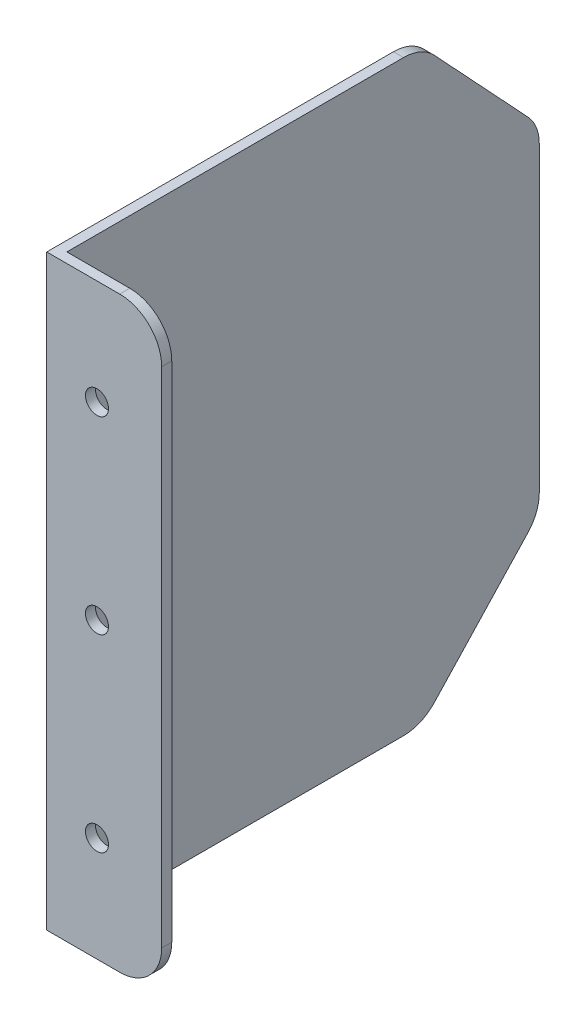
ISO-10303-21;
HEADER;
FILE_DESCRIPTION(('STEP AP214'),'2;1');
FILE_NAME('part.step','',(''),(''),'','','');
FILE_SCHEMA(('AUTOMOTIVE_DESIGN { 1 0 10303 214 1 1 1 1 }'));
ENDSEC;
DATA;
#1=APPLICATION_CONTEXT('core data for automotive mechanical design processes');
#2=APPLICATION_PROTOCOL_DEFINITION('international standard','automotive_design',2000,#1);
#3=PRODUCT_CONTEXT('',#1,'mechanical');
#4=PRODUCT('Part','Part','',(#3));
#5=PRODUCT_RELATED_PRODUCT_CATEGORY('part','',(#4));
#6=PRODUCT_DEFINITION_FORMATION('','',#4);
#7=PRODUCT_DEFINITION_CONTEXT('part definition',#1,'design');
#8=PRODUCT_DEFINITION('design','',#6,#7);
#9=PRODUCT_DEFINITION_SHAPE('','',#8);
#10=(LENGTH_UNIT() NAMED_UNIT(*) SI_UNIT(.MILLI.,.METRE.));
#11=(NAMED_UNIT(*) PLANE_ANGLE_UNIT() SI_UNIT($,.RADIAN.));
#12=(NAMED_UNIT(*) SI_UNIT($,.STERADIAN.) SOLID_ANGLE_UNIT());
#13=UNCERTAINTY_MEASURE_WITH_UNIT(LENGTH_MEASURE(1.E-05),#10,'distance_accuracy_value','');
#14=(GEOMETRIC_REPRESENTATION_CONTEXT(3) GLOBAL_UNCERTAINTY_ASSIGNED_CONTEXT((#13)) GLOBAL_UNIT_ASSIGNED_CONTEXT((#10,
#11,#12)) REPRESENTATION_CONTEXT('',''));
#15=CARTESIAN_POINT('',(0.,0.,0.));
#16=DIRECTION('',(0.,0.,1.));
#17=DIRECTION('',(1.,0.,0.));
#18=AXIS2_PLACEMENT_3D('',#15,#16,#17);
#19=CARTESIAN_POINT('',(2.4,0.,0.));
#20=DIRECTION('',(0.,0.,-1.));
#21=DIRECTION('',(0.,1.,0.));
#22=AXIS2_PLACEMENT_3D('',#19,#20,#21);
#23=PLANE('',#22);
#24=CARTESIAN_POINT('',(11.9749835807568,-115.,0.));
#25=DIRECTION('',(0.,0.,1.));
#26=DIRECTION('',(1.,0.,0.));
#27=AXIS2_PLACEMENT_3D('',#24,#25,#26);
#28=CIRCLE('',#27,2.75);
#29=CARTESIAN_POINT('',(14.7249835807568,-115.,0.));
#30=VERTEX_POINT('',#29);
#31=EDGE_CURVE('E481',#30,#30,#28,.T.);
#32=ORIENTED_EDGE('',*,*,#31,.F.);
#33=EDGE_LOOP('',(#32));
#34=FACE_BOUND('',#33,.T.);
#35=CARTESIAN_POINT('',(11.9749835807568,-25.,0.));
#36=DIRECTION('',(0.,0.,1.));
#37=DIRECTION('',(1.,0.,0.));
#38=AXIS2_PLACEMENT_3D('',#35,#36,#37);
#39=CIRCLE('',#38,2.75);
#40=CARTESIAN_POINT('',(14.7249835807568,-25.,0.));
#41=VERTEX_POINT('',#40);
#42=EDGE_CURVE('E482',#41,#41,#39,.T.);
#43=ORIENTED_EDGE('',*,*,#42,.F.);
#44=EDGE_LOOP('',(#43));
#45=FACE_BOUND('',#44,.T.);
#46=CARTESIAN_POINT('',(11.9749835807568,-70.,0.));
#47=DIRECTION('',(0.,0.,1.));
#48=DIRECTION('',(1.,0.,0.));
#49=AXIS2_PLACEMENT_3D('',#46,#47,#48);
#50=CIRCLE('',#49,2.75);
#51=CARTESIAN_POINT('',(14.7249835807568,-70.,0.));
#52=VERTEX_POINT('',#51);
#53=EDGE_CURVE('E258',#52,#52,#50,.T.);
#54=ORIENTED_EDGE('',*,*,#53,.F.);
#55=EDGE_LOOP('',(#54));
#56=FACE_BOUND('',#55,.T.);
#57=DIRECTION('',(-1.,0.,0.));
#58=VECTOR('',#57,1.);
#59=CARTESIAN_POINT('',(2.4,-140.,0.));
#60=LINE('',#59,#58);
#61=CARTESIAN_POINT('',(17.4,-140.,0.));
#62=VERTEX_POINT('',#61);
#63=CARTESIAN_POINT('',(0.,-140.,0.));
#64=VERTEX_POINT('',#63);
#65=EDGE_CURVE('E204',#62,#64,#60,.T.);
#66=ORIENTED_EDGE('',*,*,#65,.F.);
#67=CARTESIAN_POINT('',(17.4,-130.,0.));
#68=DIRECTION('',(0.,0.,-1.));
#69=DIRECTION('',(0.,1.,0.));
#70=AXIS2_PLACEMENT_3D('',#67,#68,#69);
#71=CIRCLE('',#70,10.);
#72=CARTESIAN_POINT('',(27.4,-130.,0.));
#73=VERTEX_POINT('',#72);
#74=EDGE_CURVE('E48',#62,#73,#71,.F.);
#75=ORIENTED_EDGE('',*,*,#74,.T.);
#76=DIRECTION('',(0.,-1.,0.));
#77=VECTOR('',#76,1.);
#78=CARTESIAN_POINT('',(27.4,-140.,0.));
#79=LINE('',#78,#77);
#80=CARTESIAN_POINT('',(27.4,-10.,0.));
#81=VERTEX_POINT('',#80);
#82=EDGE_CURVE('E167',#81,#73,#79,.T.);
#83=ORIENTED_EDGE('',*,*,#82,.F.);
#84=CARTESIAN_POINT('',(17.4,-10.,0.));
#85=DIRECTION('',(0.,0.,-1.));
#86=DIRECTION('',(0.,1.,0.));
#87=AXIS2_PLACEMENT_3D('',#84,#85,#86);
#88=CIRCLE('',#87,10.);
#89=CARTESIAN_POINT('',(17.4,0.,0.));
#90=VERTEX_POINT('',#89);
#91=EDGE_CURVE('E57',#81,#90,#88,.F.);
#92=ORIENTED_EDGE('',*,*,#91,.T.);
#93=DIRECTION('',(-1.,0.,0.));
#94=VECTOR('',#93,1.);
#95=CARTESIAN_POINT('',(2.4,0.,0.));
#96=LINE('',#95,#94);
#97=CARTESIAN_POINT('',(0.,0.,0.));
#98=VERTEX_POINT('',#97);
#99=EDGE_CURVE('E161',#90,#98,#96,.T.);
#100=ORIENTED_EDGE('',*,*,#99,.T.);
#101=DIRECTION('',(0.,-1.,0.));
#102=VECTOR('',#101,1.);
#103=CARTESIAN_POINT('',(0.,0.,0.));
#104=LINE('',#103,#102);
#105=EDGE_CURVE('E179',#98,#64,#104,.T.);
#106=ORIENTED_EDGE('',*,*,#105,.T.);
#107=EDGE_LOOP('',(#66,#75,#83,#92,#100,#106));
#108=FACE_BOUND('',#107,.T.);
#109=ADVANCED_FACE('F39',(#34,#45,#56,#108),#23,.F.);
#110=CARTESIAN_POINT('',(2.4,-140.,0.));
#111=DIRECTION('',(0.,1.,0.));
#112=DIRECTION('',(0.,0.,1.));
#113=AXIS2_PLACEMENT_3D('',#110,#111,#112);
#114=PLANE('',#113);
#115=DIRECTION('',(-1.,0.,0.));
#116=VECTOR('',#115,1.);
#117=CARTESIAN_POINT('',(27.4,-140.,-2.4));
#118=LINE('',#117,#116);
#119=CARTESIAN_POINT('',(17.4,-140.,-2.4));
#120=VERTEX_POINT('',#119);
#121=CARTESIAN_POINT('',(2.4,-140.,-2.4));
#122=VERTEX_POINT('',#121);
#123=EDGE_CURVE('E151',#120,#122,#118,.T.);
#124=ORIENTED_EDGE('',*,*,#123,.F.);
#125=DIRECTION('',(0.,0.,-1.));
#126=VECTOR('',#125,1.);
#127=CARTESIAN_POINT('',(17.4,-140.,0.));
#128=LINE('',#127,#126);
#129=EDGE_CURVE('E63',#120,#62,#128,.F.);
#130=ORIENTED_EDGE('',*,*,#129,.T.);
#131=ORIENTED_EDGE('',*,*,#65,.T.);
#132=DIRECTION('',(0.,0.,-1.));
#133=VECTOR('',#132,1.);
#134=CARTESIAN_POINT('',(0.,-140.,0.));
#135=LINE('',#134,#133);
#136=CARTESIAN_POINT('',(0.,-140.,-82.6544769808779));
#137=VERTEX_POINT('',#136);
#138=EDGE_CURVE('E192',#64,#137,#135,.T.);
#139=ORIENTED_EDGE('',*,*,#138,.T.);
#140=DIRECTION('',(1.,0.,0.));
#141=VECTOR('',#140,1.);
#142=CARTESIAN_POINT('',(2.4,-140.,-82.6544769808779));
#143=LINE('',#142,#141);
#144=CARTESIAN_POINT('',(2.4,-140.,-82.6544769808779));
#145=VERTEX_POINT('',#144);
#146=EDGE_CURVE('E206',#137,#145,#143,.T.);
#147=ORIENTED_EDGE('',*,*,#146,.T.);
#148=DIRECTION('',(0.,0.,-1.));
#149=VECTOR('',#148,1.);
#150=CARTESIAN_POINT('',(2.4,-140.,0.));
#151=LINE('',#150,#149);
#152=EDGE_CURVE('E187',#122,#145,#151,.T.);
#153=ORIENTED_EDGE('',*,*,#152,.F.);
#154=EDGE_LOOP('',(#124,#130,#131,#139,#147,#153));
#155=FACE_BOUND('',#154,.T.);
#156=ADVANCED_FACE('F279',(#155),#114,.F.);
#157=CARTESIAN_POINT('',(2.4,0.,-115.));
#158=DIRECTION('',(0.,0.,1.));
#159=DIRECTION('',(0.,-1.,0.));
#160=AXIS2_PLACEMENT_3D('',#157,#158,#159);
#161=PLANE('',#160);
#162=DIRECTION('',(0.,1.,0.));
#163=VECTOR('',#162,1.);
#164=CARTESIAN_POINT('',(2.4,0.,-115.));
#165=LINE('',#164,#163);
#166=CARTESIAN_POINT('',(2.4,-106.058368193798,-115.));
#167=VERTEX_POINT('',#166);
#168=CARTESIAN_POINT('',(2.4,-33.9416318062023,-115.));
#169=VERTEX_POINT('',#168);
#170=EDGE_CURVE('E165',#167,#169,#165,.T.);
#171=ORIENTED_EDGE('',*,*,#170,.F.);
#172=DIRECTION('',(1.,0.,0.));
#173=VECTOR('',#172,1.);
#174=CARTESIAN_POINT('',(2.4,-106.058368193798,-115.));
#175=LINE('',#174,#173);
#176=CARTESIAN_POINT('',(0.,-106.058368193798,-115.));
#177=VERTEX_POINT('',#176);
#178=EDGE_CURVE('E235',#167,#177,#175,.F.);
#179=ORIENTED_EDGE('',*,*,#178,.T.);
#180=DIRECTION('',(0.,1.,0.));
#181=VECTOR('',#180,1.);
#182=CARTESIAN_POINT('',(0.,0.,-115.));
#183=LINE('',#182,#181);
#184=CARTESIAN_POINT('',(0.,-33.9416318062023,-115.));
#185=VERTEX_POINT('',#184);
#186=EDGE_CURVE('E196',#177,#185,#183,.T.);
#187=ORIENTED_EDGE('',*,*,#186,.T.);
#188=DIRECTION('',(1.,0.,0.));
#189=VECTOR('',#188,1.);
#190=CARTESIAN_POINT('',(2.4,-33.9416318062023,-115.));
#191=LINE('',#190,#189);
#192=EDGE_CURVE('E228',#185,#169,#191,.T.);
#193=ORIENTED_EDGE('',*,*,#192,.T.);
#194=EDGE_LOOP('',(#171,#179,#187,#193));
#195=FACE_BOUND('',#194,.T.);
#196=ADVANCED_FACE('F288',(#195),#161,.F.);
#197=CARTESIAN_POINT('',(2.4,0.,0.));
#198=DIRECTION('',(0.,-1.,0.));
#199=DIRECTION('',(0.,0.,-1.));
#200=AXIS2_PLACEMENT_3D('',#197,#198,#199);
#201=PLANE('',#200);
#202=ORIENTED_EDGE('',*,*,#99,.F.);
#203=DIRECTION('',(0.,0.,1.));
#204=VECTOR('',#203,1.);
#205=CARTESIAN_POINT('',(17.4,0.,0.));
#206=LINE('',#205,#204);
#207=CARTESIAN_POINT('',(17.4,0.,-2.4));
#208=VERTEX_POINT('',#207);
#209=EDGE_CURVE('E11',#90,#208,#206,.F.);
#210=ORIENTED_EDGE('',*,*,#209,.T.);
#211=DIRECTION('',(-1.,0.,0.));
#212=VECTOR('',#211,1.);
#213=CARTESIAN_POINT('',(27.4,0.,-2.4));
#214=LINE('',#213,#212);
#215=CARTESIAN_POINT('',(2.4,0.,-2.4));
#216=VERTEX_POINT('',#215);
#217=EDGE_CURVE('E142',#208,#216,#214,.T.);
#218=ORIENTED_EDGE('',*,*,#217,.T.);
#219=DIRECTION('',(0.,0.,1.));
#220=VECTOR('',#219,1.);
#221=CARTESIAN_POINT('',(2.4,0.,0.));
#222=LINE('',#221,#220);
#223=CARTESIAN_POINT('',(2.4,0.,-82.6544769808779));
#224=VERTEX_POINT('',#223);
#225=EDGE_CURVE('E144',#224,#216,#222,.T.);
#226=ORIENTED_EDGE('',*,*,#225,.F.);
#227=DIRECTION('',(1.,0.,0.));
#228=VECTOR('',#227,1.);
#229=CARTESIAN_POINT('',(2.4,0.,-82.6544769808779));
#230=LINE('',#229,#228);
#231=CARTESIAN_POINT('',(0.,0.,-82.6544769808779));
#232=VERTEX_POINT('',#231);
#233=EDGE_CURVE('E239',#224,#232,#230,.F.);
#234=ORIENTED_EDGE('',*,*,#233,.T.);
#235=DIRECTION('',(0.,0.,1.));
#236=VECTOR('',#235,1.);
#237=CARTESIAN_POINT('',(0.,0.,0.));
#238=LINE('',#237,#236);
#239=EDGE_CURVE('E189',#232,#98,#238,.T.);
#240=ORIENTED_EDGE('',*,*,#239,.T.);
#241=EDGE_LOOP('',(#202,#210,#218,#226,#234,#240));
#242=FACE_BOUND('',#241,.T.);
#243=ADVANCED_FACE('F145',(#242),#201,.F.);
#244=CARTESIAN_POINT('',(2.4,0.,0.));
#245=DIRECTION('',(1.,0.,0.));
#246=DIRECTION('',(0.,0.,-1.));
#247=AXIS2_PLACEMENT_3D('',#244,#245,#246);
#248=PLANE('',#247);
#249=DIRECTION('',(0.,1.,0.));
#250=VECTOR('',#249,1.);
#251=CARTESIAN_POINT('',(2.4,-140.,-2.4));
#252=LINE('',#251,#250);
#253=EDGE_CURVE('E160',#122,#216,#252,.T.);
#254=ORIENTED_EDGE('',*,*,#253,.F.);
#255=ORIENTED_EDGE('',*,*,#152,.T.);
#256=CARTESIAN_POINT('',(2.4,-130.,-82.6544769808779));
#257=DIRECTION('',(1.,0.,0.));
#258=DIRECTION('',(0.,0.,-1.));
#259=AXIS2_PLACEMENT_3D('',#256,#257,#258);
#260=CIRCLE('',#259,10.);
#261=CARTESIAN_POINT('',(2.4,-136.8231825036,-89.9650296633066));
#262=VERTEX_POINT('',#261);
#263=EDGE_CURVE('E212',#145,#262,#260,.T.);
#264=ORIENTED_EDGE('',*,*,#263,.T.);
#265=DIRECTION('',(0.,-0.731055268242869,0.682318250360011));
#266=VECTOR('',#265,1.);
#267=CARTESIAN_POINT('',(2.4,-110.,-115.));
#268=LINE('',#267,#266);
#269=CARTESIAN_POINT('',(2.4,-112.881550697398,-112.310552682429));
#270=VERTEX_POINT('',#269);
#271=EDGE_CURVE('E181',#270,#262,#268,.T.);
#272=ORIENTED_EDGE('',*,*,#271,.F.);
#273=CARTESIAN_POINT('',(2.4,-106.058368193798,-105.));
#274=DIRECTION('',(1.,0.,0.));
#275=DIRECTION('',(0.,0.,-1.));
#276=AXIS2_PLACEMENT_3D('',#273,#274,#275);
#277=CIRCLE('',#276,10.);
#278=EDGE_CURVE('E215',#270,#167,#277,.T.);
#279=ORIENTED_EDGE('',*,*,#278,.T.);
#280=ORIENTED_EDGE('',*,*,#170,.T.);
#281=CARTESIAN_POINT('',(2.4,-33.9416318062023,-105.));
#282=DIRECTION('',(1.,0.,0.));
#283=DIRECTION('',(0.,0.,-1.));
#284=AXIS2_PLACEMENT_3D('',#281,#282,#283);
#285=CIRCLE('',#284,10.);
#286=CARTESIAN_POINT('',(2.4,-27.1184493026022,-112.310552682429));
#287=VERTEX_POINT('',#286);
#288=EDGE_CURVE('E209',#169,#287,#285,.T.);
#289=ORIENTED_EDGE('',*,*,#288,.T.);
#290=DIRECTION('',(0.,-0.731055268242869,-0.682318250360012));
#291=VECTOR('',#290,1.);
#292=CARTESIAN_POINT('',(2.4,0.,-87.));
#293=LINE('',#292,#291);
#294=CARTESIAN_POINT('',(2.4,-3.17681749639988,-89.9650296633066));
#295=VERTEX_POINT('',#294);
#296=EDGE_CURVE('E177',#295,#287,#293,.T.);
#297=ORIENTED_EDGE('',*,*,#296,.F.);
#298=CARTESIAN_POINT('',(2.4,-10.,-82.6544769808779));
#299=DIRECTION('',(1.,0.,0.));
#300=DIRECTION('',(0.,0.,-1.));
#301=AXIS2_PLACEMENT_3D('',#298,#299,#300);
#302=CIRCLE('',#301,10.);
#303=EDGE_CURVE('E159',#295,#224,#302,.T.);
#304=ORIENTED_EDGE('',*,*,#303,.T.);
#305=ORIENTED_EDGE('',*,*,#225,.T.);
#306=EDGE_LOOP('',(#254,#255,#264,#272,#279,#280,#289,#297,#304,#305));
#307=FACE_BOUND('',#306,.T.);
#308=ADVANCED_FACE('F156',(#307),#248,.T.);
#309=CARTESIAN_POINT('',(0.,0.,0.));
#310=DIRECTION('',(1.,0.,0.));
#311=DIRECTION('',(0.,0.,-1.));
#312=AXIS2_PLACEMENT_3D('',#309,#310,#311);
#313=PLANE('',#312);
#314=DIRECTION('',(0.,-0.731055268242869,0.682318250360011));
#315=VECTOR('',#314,1.);
#316=CARTESIAN_POINT('',(0.,-110.,-115.));
#317=LINE('',#316,#315);
#318=CARTESIAN_POINT('',(0.,-112.881550697398,-112.310552682429));
#319=VERTEX_POINT('',#318);
#320=CARTESIAN_POINT('',(0.,-136.8231825036,-89.9650296633066));
#321=VERTEX_POINT('',#320);
#322=EDGE_CURVE('E174',#319,#321,#317,.T.);
#323=ORIENTED_EDGE('',*,*,#322,.T.);
#324=CARTESIAN_POINT('',(0.,-130.,-82.6544769808779));
#325=DIRECTION('',(1.,0.,0.));
#326=DIRECTION('',(0.,0.,-1.));
#327=AXIS2_PLACEMENT_3D('',#324,#325,#326);
#328=CIRCLE('',#327,10.);
#329=EDGE_CURVE('E230',#321,#137,#328,.F.);
#330=ORIENTED_EDGE('',*,*,#329,.T.);
#331=ORIENTED_EDGE('',*,*,#138,.F.);
#332=ORIENTED_EDGE('',*,*,#105,.F.);
#333=ORIENTED_EDGE('',*,*,#239,.F.);
#334=CARTESIAN_POINT('',(0.,-10.,-82.6544769808779));
#335=DIRECTION('',(1.,0.,0.));
#336=DIRECTION('',(0.,0.,-1.));
#337=AXIS2_PLACEMENT_3D('',#334,#335,#336);
#338=CIRCLE('',#337,10.);
#339=CARTESIAN_POINT('',(0.,-3.17681749639988,-89.9650296633066));
#340=VERTEX_POINT('',#339);
#341=EDGE_CURVE('E222',#232,#340,#338,.F.);
#342=ORIENTED_EDGE('',*,*,#341,.T.);
#343=DIRECTION('',(0.,-0.731055268242869,-0.682318250360012));
#344=VECTOR('',#343,1.);
#345=CARTESIAN_POINT('',(0.,0.,-87.));
#346=LINE('',#345,#344);
#347=CARTESIAN_POINT('',(0.,-27.1184493026022,-112.310552682429));
#348=VERTEX_POINT('',#347);
#349=EDGE_CURVE('E178',#340,#348,#346,.T.);
#350=ORIENTED_EDGE('',*,*,#349,.T.);
#351=CARTESIAN_POINT('',(0.,-33.9416318062023,-105.));
#352=DIRECTION('',(1.,0.,0.));
#353=DIRECTION('',(0.,0.,-1.));
#354=AXIS2_PLACEMENT_3D('',#351,#352,#353);
#355=CIRCLE('',#354,10.);
#356=EDGE_CURVE('E224',#348,#185,#355,.F.);
#357=ORIENTED_EDGE('',*,*,#356,.T.);
#358=ORIENTED_EDGE('',*,*,#186,.F.);
#359=CARTESIAN_POINT('',(0.,-106.058368193798,-105.));
#360=DIRECTION('',(1.,0.,0.));
#361=DIRECTION('',(0.,0.,-1.));
#362=AXIS2_PLACEMENT_3D('',#359,#360,#361);
#363=CIRCLE('',#362,10.);
#364=EDGE_CURVE('E223',#177,#319,#363,.F.);
#365=ORIENTED_EDGE('',*,*,#364,.T.);
#366=EDGE_LOOP('',(#323,#330,#331,#332,#333,#342,#350,#357,#358,#365));
#367=FACE_BOUND('',#366,.T.);
#368=ADVANCED_FACE('F332',(#367),#313,.F.);
#369=CARTESIAN_POINT('',(0.,0.,-87.));
#370=DIRECTION('',(0.,-0.682318250360011,0.731055268242869));
#371=DIRECTION('',(0.,-0.731055268242869,-0.682318250360012));
#372=AXIS2_PLACEMENT_3D('',#369,#370,#371);
#373=PLANE('',#372);
#374=ORIENTED_EDGE('',*,*,#296,.T.);
#375=DIRECTION('',(1.,0.,0.));
#376=VECTOR('',#375,1.);
#377=CARTESIAN_POINT('',(0.,-27.1184493026021,-112.310552682429));
#378=LINE('',#377,#376);
#379=EDGE_CURVE('E240',#287,#348,#378,.F.);
#380=ORIENTED_EDGE('',*,*,#379,.T.);
#381=ORIENTED_EDGE('',*,*,#349,.F.);
#382=DIRECTION('',(1.,0.,0.));
#383=VECTOR('',#382,1.);
#384=CARTESIAN_POINT('',(0.,-3.17681749639988,-89.9650296633066));
#385=LINE('',#384,#383);
#386=EDGE_CURVE('E234',#340,#295,#385,.T.);
#387=ORIENTED_EDGE('',*,*,#386,.T.);
#388=EDGE_LOOP('',(#374,#380,#381,#387));
#389=FACE_BOUND('',#388,.T.);
#390=ADVANCED_FACE('F345',(#389),#373,.F.);
#391=CARTESIAN_POINT('',(0.,-110.,-115.));
#392=DIRECTION('',(0.,0.682318250360011,0.731055268242869));
#393=DIRECTION('',(0.,-0.731055268242869,0.682318250360011));
#394=AXIS2_PLACEMENT_3D('',#391,#392,#393);
#395=PLANE('',#394);
#396=ORIENTED_EDGE('',*,*,#271,.T.);
#397=DIRECTION('',(1.,0.,0.));
#398=VECTOR('',#397,1.);
#399=CARTESIAN_POINT('',(0.,-136.8231825036,-89.9650296633066));
#400=LINE('',#399,#398);
#401=EDGE_CURVE('E218',#262,#321,#400,.F.);
#402=ORIENTED_EDGE('',*,*,#401,.T.);
#403=ORIENTED_EDGE('',*,*,#322,.F.);
#404=DIRECTION('',(1.,0.,0.));
#405=VECTOR('',#404,1.);
#406=CARTESIAN_POINT('',(0.,-112.881550697398,-112.310552682429));
#407=LINE('',#406,#405);
#408=EDGE_CURVE('E216',#319,#270,#407,.T.);
#409=ORIENTED_EDGE('',*,*,#408,.T.);
#410=EDGE_LOOP('',(#396,#402,#403,#409));
#411=FACE_BOUND('',#410,.T.);
#412=ADVANCED_FACE('F296',(#411),#395,.F.);
#413=CARTESIAN_POINT('',(2.4,-130.,-82.6544769808779));
#414=DIRECTION('',(1.,0.,0.));
#415=DIRECTION('',(0.,0.,-1.));
#416=AXIS2_PLACEMENT_3D('',#413,#414,#415);
#417=CYLINDRICAL_SURFACE('',#416,10.);
#418=ORIENTED_EDGE('',*,*,#329,.F.);
#419=ORIENTED_EDGE('',*,*,#401,.F.);
#420=ORIENTED_EDGE('',*,*,#263,.F.);
#421=ORIENTED_EDGE('',*,*,#146,.F.);
#422=EDGE_LOOP('',(#418,#419,#420,#421));
#423=FACE_BOUND('',#422,.T.);
#424=ADVANCED_FACE('F295',(#423),#417,.T.);
#425=CARTESIAN_POINT('',(0.,-106.058368193798,-105.));
#426=DIRECTION('',(1.,0.,0.));
#427=DIRECTION('',(0.,0.,-1.));
#428=AXIS2_PLACEMENT_3D('',#425,#426,#427);
#429=CYLINDRICAL_SURFACE('',#428,10.);
#430=ORIENTED_EDGE('',*,*,#364,.F.);
#431=ORIENTED_EDGE('',*,*,#178,.F.);
#432=ORIENTED_EDGE('',*,*,#278,.F.);
#433=ORIENTED_EDGE('',*,*,#408,.F.);
#434=EDGE_LOOP('',(#430,#431,#432,#433));
#435=FACE_BOUND('',#434,.T.);
#436=ADVANCED_FACE('F293',(#435),#429,.T.);
#437=CARTESIAN_POINT('',(2.4,-33.9416318062023,-105.));
#438=DIRECTION('',(1.,0.,0.));
#439=DIRECTION('',(0.,0.,-1.));
#440=AXIS2_PLACEMENT_3D('',#437,#438,#439);
#441=CYLINDRICAL_SURFACE('',#440,10.);
#442=ORIENTED_EDGE('',*,*,#356,.F.);
#443=ORIENTED_EDGE('',*,*,#379,.F.);
#444=ORIENTED_EDGE('',*,*,#288,.F.);
#445=ORIENTED_EDGE('',*,*,#192,.F.);
#446=EDGE_LOOP('',(#442,#443,#444,#445));
#447=FACE_BOUND('',#446,.T.);
#448=ADVANCED_FACE('F299',(#447),#441,.T.);
#449=CARTESIAN_POINT('',(0.,-10.,-82.6544769808779));
#450=DIRECTION('',(1.,0.,0.));
#451=DIRECTION('',(0.,0.,-1.));
#452=AXIS2_PLACEMENT_3D('',#449,#450,#451);
#453=CYLINDRICAL_SURFACE('',#452,10.);
#454=ORIENTED_EDGE('',*,*,#341,.F.);
#455=ORIENTED_EDGE('',*,*,#233,.F.);
#456=ORIENTED_EDGE('',*,*,#303,.F.);
#457=ORIENTED_EDGE('',*,*,#386,.F.);
#458=EDGE_LOOP('',(#454,#455,#456,#457));
#459=FACE_BOUND('',#458,.T.);
#460=ADVANCED_FACE('F304',(#459),#453,.T.);
#461=CARTESIAN_POINT('',(27.4,-140.,-2.4));
#462=DIRECTION('',(0.,0.,1.));
#463=DIRECTION('',(1.,0.,0.));
#464=AXIS2_PLACEMENT_3D('',#461,#462,#463);
#465=PLANE('',#464);
#466=CARTESIAN_POINT('',(11.9749835807568,-115.,-2.4));
#467=DIRECTION('',(0.,0.,1.));
#468=DIRECTION('',(1.,0.,0.));
#469=AXIS2_PLACEMENT_3D('',#466,#467,#468);
#470=CIRCLE('',#469,2.75);
#471=CARTESIAN_POINT('',(14.7249835807568,-115.,-2.4));
#472=VERTEX_POINT('',#471);
#473=EDGE_CURVE('E43',#472,#472,#470,.T.);
#474=ORIENTED_EDGE('',*,*,#473,.T.);
#475=EDGE_LOOP('',(#474));
#476=FACE_BOUND('',#475,.T.);
#477=CARTESIAN_POINT('',(11.9749835807568,-25.,-2.4));
#478=DIRECTION('',(0.,0.,1.));
#479=DIRECTION('',(1.,0.,0.));
#480=AXIS2_PLACEMENT_3D('',#477,#478,#479);
#481=CIRCLE('',#480,2.75);
#482=CARTESIAN_POINT('',(14.7249835807568,-25.,-2.4));
#483=VERTEX_POINT('',#482);
#484=EDGE_CURVE('E171',#483,#483,#481,.T.);
#485=ORIENTED_EDGE('',*,*,#484,.T.);
#486=EDGE_LOOP('',(#485));
#487=FACE_BOUND('',#486,.T.);
#488=CARTESIAN_POINT('',(11.9749835807568,-70.,-2.4));
#489=DIRECTION('',(0.,0.,1.));
#490=DIRECTION('',(1.,0.,0.));
#491=AXIS2_PLACEMENT_3D('',#488,#489,#490);
#492=CIRCLE('',#491,2.75);
#493=CARTESIAN_POINT('',(14.7249835807568,-70.,-2.4));
#494=VERTEX_POINT('',#493);
#495=EDGE_CURVE('E255',#494,#494,#492,.T.);
#496=ORIENTED_EDGE('',*,*,#495,.T.);
#497=EDGE_LOOP('',(#496));
#498=FACE_BOUND('',#497,.T.);
#499=DIRECTION('',(0.,1.,0.));
#500=VECTOR('',#499,1.);
#501=CARTESIAN_POINT('',(27.4,-140.,-2.4));
#502=LINE('',#501,#500);
#503=CARTESIAN_POINT('',(27.4,-130.,-2.4));
#504=VERTEX_POINT('',#503);
#505=CARTESIAN_POINT('',(27.4,-10.,-2.4));
#506=VERTEX_POINT('',#505);
#507=EDGE_CURVE('E155',#504,#506,#502,.T.);
#508=ORIENTED_EDGE('',*,*,#507,.F.);
#509=CARTESIAN_POINT('',(17.4,-130.,-2.4));
#510=DIRECTION('',(0.,0.,1.));
#511=DIRECTION('',(1.,0.,0.));
#512=AXIS2_PLACEMENT_3D('',#509,#510,#511);
#513=CIRCLE('',#512,10.);
#514=EDGE_CURVE('E249',#504,#120,#513,.F.);
#515=ORIENTED_EDGE('',*,*,#514,.T.);
#516=ORIENTED_EDGE('',*,*,#123,.T.);
#517=ORIENTED_EDGE('',*,*,#253,.T.);
#518=ORIENTED_EDGE('',*,*,#217,.F.);
#519=CARTESIAN_POINT('',(17.4,-10.,-2.4));
#520=DIRECTION('',(0.,0.,1.));
#521=DIRECTION('',(1.,0.,0.));
#522=AXIS2_PLACEMENT_3D('',#519,#520,#521);
#523=CIRCLE('',#522,10.);
#524=EDGE_CURVE('E250',#208,#506,#523,.F.);
#525=ORIENTED_EDGE('',*,*,#524,.T.);
#526=EDGE_LOOP('',(#508,#515,#516,#517,#518,#525));
#527=FACE_BOUND('',#526,.T.);
#528=ADVANCED_FACE('F164',(#476,#487,#498,#527),#465,.F.);
#529=CARTESIAN_POINT('',(27.4,0.,0.));
#530=DIRECTION('',(-1.,0.,0.));
#531=DIRECTION('',(0.,0.,1.));
#532=AXIS2_PLACEMENT_3D('',#529,#530,#531);
#533=PLANE('',#532);
#534=ORIENTED_EDGE('',*,*,#82,.T.);
#535=DIRECTION('',(0.,0.,-1.));
#536=VECTOR('',#535,1.);
#537=CARTESIAN_POINT('',(27.4,-130.,0.));
#538=LINE('',#537,#536);
#539=EDGE_CURVE('E243',#73,#504,#538,.T.);
#540=ORIENTED_EDGE('',*,*,#539,.T.);
#541=ORIENTED_EDGE('',*,*,#507,.T.);
#542=DIRECTION('',(0.,0.,1.));
#543=VECTOR('',#542,1.);
#544=CARTESIAN_POINT('',(27.4,-10.,0.));
#545=LINE('',#544,#543);
#546=EDGE_CURVE('E241',#506,#81,#545,.T.);
#547=ORIENTED_EDGE('',*,*,#546,.T.);
#548=EDGE_LOOP('',(#534,#540,#541,#547));
#549=FACE_BOUND('',#548,.T.);
#550=ADVANCED_FACE('F309',(#549),#533,.F.);
#551=CARTESIAN_POINT('',(17.4,-130.,0.));
#552=DIRECTION('',(0.,0.,-1.));
#553=DIRECTION('',(-1.,0.,0.));
#554=AXIS2_PLACEMENT_3D('',#551,#552,#553);
#555=CYLINDRICAL_SURFACE('',#554,10.);
#556=ORIENTED_EDGE('',*,*,#74,.F.);
#557=ORIENTED_EDGE('',*,*,#129,.F.);
#558=ORIENTED_EDGE('',*,*,#514,.F.);
#559=ORIENTED_EDGE('',*,*,#539,.F.);
#560=EDGE_LOOP('',(#556,#557,#558,#559));
#561=FACE_BOUND('',#560,.T.);
#562=ADVANCED_FACE('F306',(#561),#555,.T.);
#563=CARTESIAN_POINT('',(17.4,-10.,0.));
#564=DIRECTION('',(0.,0.,1.));
#565=DIRECTION('',(1.,0.,0.));
#566=AXIS2_PLACEMENT_3D('',#563,#564,#565);
#567=CYLINDRICAL_SURFACE('',#566,10.);
#568=ORIENTED_EDGE('',*,*,#524,.F.);
#569=ORIENTED_EDGE('',*,*,#209,.F.);
#570=ORIENTED_EDGE('',*,*,#91,.F.);
#571=ORIENTED_EDGE('',*,*,#546,.F.);
#572=EDGE_LOOP('',(#568,#569,#570,#571));
#573=FACE_BOUND('',#572,.T.);
#574=ADVANCED_FACE('F41',(#573),#567,.T.);
#575=CARTESIAN_POINT('',(11.9749835807568,-70.,-115.));
#576=DIRECTION('',(0.,0.,1.));
#577=DIRECTION('',(1.,0.,0.));
#578=AXIS2_PLACEMENT_3D('',#575,#576,#577);
#579=CYLINDRICAL_SURFACE('',#578,2.75);
#580=ORIENTED_EDGE('',*,*,#53,.T.);
#581=EDGE_LOOP('',(#580));
#582=FACE_BOUND('',#581,.T.);
#583=ORIENTED_EDGE('',*,*,#495,.F.);
#584=EDGE_LOOP('',(#583));
#585=FACE_BOUND('',#584,.T.);
#586=ADVANCED_FACE('F264',(#582,#585),#579,.F.);
#587=CARTESIAN_POINT('',(11.9749835807568,-25.,-115.));
#588=DIRECTION('',(0.,0.,1.));
#589=DIRECTION('',(1.,0.,0.));
#590=AXIS2_PLACEMENT_3D('',#587,#588,#589);
#591=CYLINDRICAL_SURFACE('',#590,2.75);
#592=ORIENTED_EDGE('',*,*,#42,.T.);
#593=EDGE_LOOP('',(#592));
#594=FACE_BOUND('',#593,.T.);
#595=ORIENTED_EDGE('',*,*,#484,.F.);
#596=EDGE_LOOP('',(#595));
#597=FACE_BOUND('',#596,.T.);
#598=ADVANCED_FACE('F265',(#594,#597),#591,.F.);
#599=CARTESIAN_POINT('',(11.9749835807568,-115.,-115.));
#600=DIRECTION('',(0.,0.,1.));
#601=DIRECTION('',(1.,0.,0.));
#602=AXIS2_PLACEMENT_3D('',#599,#600,#601);
#603=CYLINDRICAL_SURFACE('',#602,2.75);
#604=ORIENTED_EDGE('',*,*,#31,.T.);
#605=EDGE_LOOP('',(#604));
#606=FACE_BOUND('',#605,.T.);
#607=ORIENTED_EDGE('',*,*,#473,.F.);
#608=EDGE_LOOP('',(#607));
#609=FACE_BOUND('',#608,.T.);
#610=ADVANCED_FACE('F262',(#606,#609),#603,.F.);
#611=CLOSED_SHELL('',(#109,#156,#196,#243,#308,#368,#390,#412,#424,#436,#448,#460,#528,#550,
#562,#574,#586,#598,#610));
#612=MANIFOLD_SOLID_BREP('B2',#611);
#613=ADVANCED_BREP_SHAPE_REPRESENTATION('',(#18,#612),#14);
#614=SHAPE_DEFINITION_REPRESENTATION(#9,#613);
ENDSEC;
END-ISO-10303-21;
